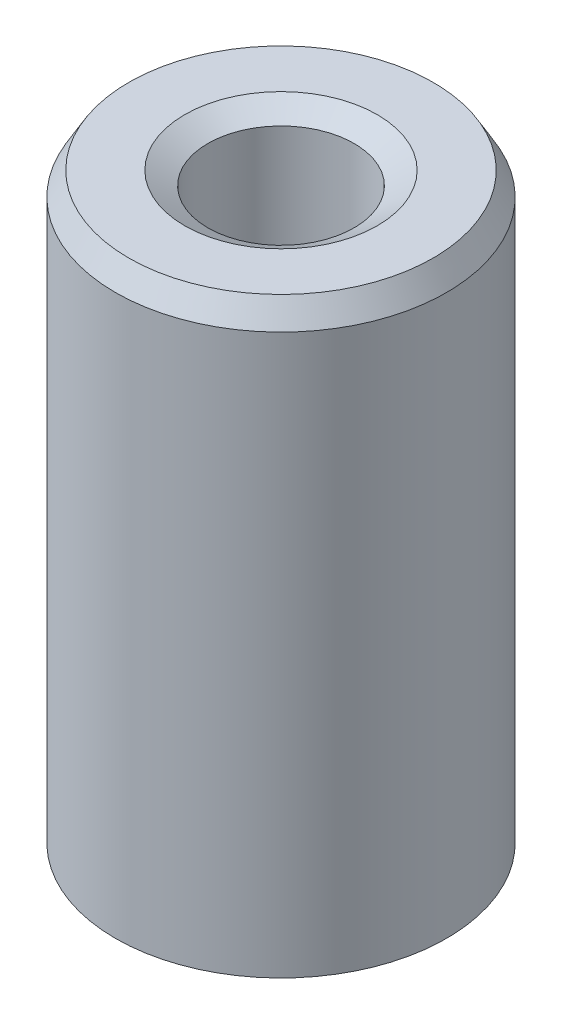
ISO-10303-21;
HEADER;
FILE_DESCRIPTION(('STEP AP214'),'2;1');
FILE_NAME('part.step','',(''),(''),'','','');
FILE_SCHEMA(('AUTOMOTIVE_DESIGN { 1 0 10303 214 1 1 1 1 }'));
ENDSEC;
DATA;
#1=APPLICATION_CONTEXT('core data for automotive mechanical design processes');
#2=APPLICATION_PROTOCOL_DEFINITION('international standard','automotive_design',2000,#1);
#3=PRODUCT_CONTEXT('',#1,'mechanical');
#4=PRODUCT('Part','Part','',(#3));
#5=PRODUCT_RELATED_PRODUCT_CATEGORY('part','',(#4));
#6=PRODUCT_DEFINITION_FORMATION('','',#4);
#7=PRODUCT_DEFINITION_CONTEXT('part definition',#1,'design');
#8=PRODUCT_DEFINITION('design','',#6,#7);
#9=PRODUCT_DEFINITION_SHAPE('','',#8);
#10=(LENGTH_UNIT() NAMED_UNIT(*) SI_UNIT(.MILLI.,.METRE.));
#11=(NAMED_UNIT(*) PLANE_ANGLE_UNIT() SI_UNIT($,.RADIAN.));
#12=(NAMED_UNIT(*) SI_UNIT($,.STERADIAN.) SOLID_ANGLE_UNIT());
#13=UNCERTAINTY_MEASURE_WITH_UNIT(LENGTH_MEASURE(1.E-05),#10,'distance_accuracy_value','');
#14=(GEOMETRIC_REPRESENTATION_CONTEXT(3) GLOBAL_UNCERTAINTY_ASSIGNED_CONTEXT((#13)) GLOBAL_UNIT_ASSIGNED_CONTEXT((#10,
#11,#12)) REPRESENTATION_CONTEXT('',''));
#15=CARTESIAN_POINT('',(0.,0.,0.));
#16=DIRECTION('',(0.,0.,1.));
#17=DIRECTION('',(1.,0.,0.));
#18=AXIS2_PLACEMENT_3D('',#15,#16,#17);
#19=CARTESIAN_POINT('',(0.,80.9748100954943,0.));
#20=DIRECTION('',(0.,-1.,0.));
#21=DIRECTION('',(0.,0.,-1.));
#22=AXIS2_PLACEMENT_3D('',#19,#20,#21);
#23=CYLINDRICAL_SURFACE('',#22,22.5);
#24=CARTESIAN_POINT('',(0.,1.81710164754692,0.));
#25=DIRECTION('',(0.,1.,0.));
#26=DIRECTION('',(0.,0.,1.));
#27=AXIS2_PLACEMENT_3D('',#24,#25,#26);
#28=CIRCLE('',#27,22.5);
#29=CARTESIAN_POINT('',(0.,1.81710164754692,22.5));
#30=VERTEX_POINT('',#29);
#31=EDGE_CURVE('E10',#30,#30,#28,.T.);
#32=ORIENTED_EDGE('',*,*,#31,.T.);
#33=EDGE_LOOP('',(#32));
#34=FACE_BOUND('',#33,.T.);
#35=CARTESIAN_POINT('',(0.,77.8274977194259,0.));
#36=DIRECTION('',(0.,1.,0.));
#37=DIRECTION('',(0.,0.,1.));
#38=AXIS2_PLACEMENT_3D('',#35,#36,#37);
#39=CIRCLE('',#38,22.5);
#40=CARTESIAN_POINT('',(0.,77.8274977194259,22.5));
#41=VERTEX_POINT('',#40);
#42=EDGE_CURVE('E50',#41,#41,#39,.F.);
#43=ORIENTED_EDGE('',*,*,#42,.T.);
#44=EDGE_LOOP('',(#43));
#45=FACE_BOUND('',#44,.T.);
#46=ADVANCED_FACE('F39',(#34,#45),#23,.T.);
#47=CARTESIAN_POINT('',(0.,80.9748100954943,0.));
#48=DIRECTION('',(0.,1.,0.));
#49=DIRECTION('',(0.,0.,1.));
#50=AXIS2_PLACEMENT_3D('',#47,#48,#49);
#51=PLANE('',#50);
#52=CARTESIAN_POINT('',(0.,80.9748100954943,0.));
#53=DIRECTION('',(0.,1.,0.));
#54=DIRECTION('',(0.,0.,1.));
#55=AXIS2_PLACEMENT_3D('',#52,#53,#54);
#56=CIRCLE('',#55,13.0852176142285);
#57=CARTESIAN_POINT('',(0.,80.9748100954943,13.0852176142285));
#58=VERTEX_POINT('',#57);
#59=EDGE_CURVE('E58',#58,#58,#56,.F.);
#60=ORIENTED_EDGE('',*,*,#59,.T.);
#61=EDGE_LOOP('',(#60));
#62=FACE_BOUND('',#61,.T.);
#63=CARTESIAN_POINT('',(0.,80.9748100954943,0.));
#64=DIRECTION('',(0.,1.,0.));
#65=DIRECTION('',(0.,0.,1.));
#66=AXIS2_PLACEMENT_3D('',#63,#64,#65);
#67=CIRCLE('',#66,20.6828983524531);
#68=CARTESIAN_POINT('',(0.,80.9748100954943,20.6828983524531));
#69=VERTEX_POINT('',#68);
#70=EDGE_CURVE('E61',#69,#69,#67,.T.);
#71=ORIENTED_EDGE('',*,*,#70,.T.);
#72=EDGE_LOOP('',(#71));
#73=FACE_BOUND('',#72,.T.);
#74=ADVANCED_FACE('F88',(#62,#73),#51,.T.);
#75=CARTESIAN_POINT('',(0.,0.,0.));
#76=DIRECTION('',(0.,1.,0.));
#77=DIRECTION('',(0.,0.,1.));
#78=AXIS2_PLACEMENT_3D('',#75,#76,#77);
#79=PLANE('',#78);
#80=CARTESIAN_POINT('',(0.,0.,0.));
#81=DIRECTION('',(0.,1.,0.));
#82=DIRECTION('',(0.,0.,1.));
#83=AXIS2_PLACEMENT_3D('',#80,#81,#82);
#84=CIRCLE('',#83,11.755006885707);
#85=CARTESIAN_POINT('',(0.,0.,11.755006885707));
#86=VERTEX_POINT('',#85);
#87=EDGE_CURVE('E51',#86,#86,#84,.T.);
#88=ORIENTED_EDGE('',*,*,#87,.T.);
#89=EDGE_LOOP('',(#88));
#90=FACE_BOUND('',#89,.T.);
#91=CARTESIAN_POINT('',(0.,0.,0.));
#92=DIRECTION('',(0.,1.,0.));
#93=DIRECTION('',(0.,0.,1.));
#94=AXIS2_PLACEMENT_3D('',#91,#92,#93);
#95=CIRCLE('',#94,19.3526876239316);
#96=CARTESIAN_POINT('',(0.,0.,19.3526876239316));
#97=VERTEX_POINT('',#96);
#98=EDGE_CURVE('E54',#97,#97,#95,.F.);
#99=ORIENTED_EDGE('',*,*,#98,.T.);
#100=EDGE_LOOP('',(#99));
#101=FACE_BOUND('',#100,.T.);
#102=ADVANCED_FACE('F83',(#90,#101),#79,.F.);
#103=CARTESIAN_POINT('',(0.,80.9748100954943,0.));
#104=DIRECTION('',(0.,-1.,0.));
#105=DIRECTION('',(0.,0.,-1.));
#106=AXIS2_PLACEMENT_3D('',#103,#104,#105);
#107=CYLINDRICAL_SURFACE('',#106,9.93790523816009);
#108=CARTESIAN_POINT('',(0.,79.1577084479474,0.));
#109=DIRECTION('',(0.,1.,0.));
#110=DIRECTION('',(0.,0.,1.));
#111=AXIS2_PLACEMENT_3D('',#108,#109,#110);
#112=CIRCLE('',#111,9.93790523816009);
#113=CARTESIAN_POINT('',(0.,79.1577084479474,9.93790523816007));
#114=VERTEX_POINT('',#113);
#115=EDGE_CURVE('E67',#114,#114,#112,.T.);
#116=ORIENTED_EDGE('',*,*,#115,.T.);
#117=EDGE_LOOP('',(#116));
#118=FACE_BOUND('',#117,.T.);
#119=CARTESIAN_POINT('',(0.,3.14731237606843,0.));
#120=DIRECTION('',(0.,1.,0.));
#121=DIRECTION('',(0.,0.,1.));
#122=AXIS2_PLACEMENT_3D('',#119,#120,#121);
#123=CIRCLE('',#122,9.93790523816009);
#124=CARTESIAN_POINT('',(0.,3.14731237606843,9.93790523816009));
#125=VERTEX_POINT('',#124);
#126=EDGE_CURVE('E69',#125,#125,#123,.F.);
#127=ORIENTED_EDGE('',*,*,#126,.T.);
#128=EDGE_LOOP('',(#127));
#129=FACE_BOUND('',#128,.T.);
#130=ADVANCED_FACE('F71',(#118,#129),#107,.F.);
#131=CARTESIAN_POINT('',(0.,79.1577084479474,0.));
#132=DIRECTION('',(0.,1.,0.));
#133=DIRECTION('',(0.,0.,1.));
#134=AXIS2_PLACEMENT_3D('',#131,#132,#133);
#135=CONICAL_SURFACE('',#134,9.93790523816009,1.0471975511966);
#136=CARTESIAN_POINT('',(0.,80.9748100954943,13.0852176142285));
#137=CARTESIAN_POINT('',(0.,80.9558819533324,13.0524331103111));
#138=CARTESIAN_POINT('',(0.,80.9369538111704,13.0196486063937));
#139=CARTESIAN_POINT('',(0.,80.8990975268465,12.954079598559));
#140=CARTESIAN_POINT('',(0.,80.8801693846846,12.9212950946416));
#141=CARTESIAN_POINT('',(0.,80.8423131003607,12.8557260868068));
#142=CARTESIAN_POINT('',(0.,80.8233849581987,12.8229415828895));
#143=CARTESIAN_POINT('',(0.,80.7855286738748,12.7573725750547));
#144=CARTESIAN_POINT('',(0.,80.7666005317129,12.7245880711373));
#145=CARTESIAN_POINT('',(0.,80.728744247389,12.6590190633026));
#146=CARTESIAN_POINT('',(0.,80.709816105227,12.6262345593852));
#147=CARTESIAN_POINT('',(0.,80.6719598209031,12.5606655515504));
#148=CARTESIAN_POINT('',(0.,80.6530316787412,12.527881047633));
#149=CARTESIAN_POINT('',(0.,80.6151753944173,12.4623120397983));
#150=CARTESIAN_POINT('',(0.,80.5962472522554,12.4295275358809));
#151=CARTESIAN_POINT('',(0.,80.5583909679314,12.3639585280461));
#152=CARTESIAN_POINT('',(0.,80.5394628257695,12.3311740241288));
#153=CARTESIAN_POINT('',(0.,80.5016065414456,12.265605016294));
#154=CARTESIAN_POINT('',(0.,80.4826783992837,12.2328205123766));
#155=CARTESIAN_POINT('',(0.,80.4448221149598,12.1672515045419));
#156=CARTESIAN_POINT('',(0.,80.4258939727978,12.1344670006245));
#157=CARTESIAN_POINT('',(0.,80.3880376884739,12.0688979927897));
#158=CARTESIAN_POINT('',(0.,80.369109546312,12.0361134888723));
#159=CARTESIAN_POINT('',(0.,80.3312532619881,11.9705444810376));
#160=CARTESIAN_POINT('',(0.,80.3123251198261,11.9377599771202));
#161=CARTESIAN_POINT('',(0.,80.2744688355022,11.8721909692855));
#162=CARTESIAN_POINT('',(0.,80.2555406933403,11.8394064653681));
#163=CARTESIAN_POINT('',(0.,80.2176844090164,11.7738374575333));
#164=CARTESIAN_POINT('',(0.,80.1987562668545,11.7410529536159));
#165=CARTESIAN_POINT('',(0.,80.1608999825306,11.6754839457812));
#166=CARTESIAN_POINT('',(0.,80.1419718403686,11.6426994418638));
#167=CARTESIAN_POINT('',(0.,80.1041155560447,11.577130434029));
#168=CARTESIAN_POINT('',(0.,80.0851874138828,11.5443459301117));
#169=CARTESIAN_POINT('',(0.,80.0473311295589,11.4787769222769));
#170=CARTESIAN_POINT('',(0.,80.0284029873969,11.4459924183595));
#171=CARTESIAN_POINT('',(0.,79.990546703073,11.3804234105248));
#172=CARTESIAN_POINT('',(0.,79.9716185609111,11.3476389066074));
#173=CARTESIAN_POINT('',(0.,79.9337622765872,11.2820698987726));
#174=CARTESIAN_POINT('',(0.,79.9148341344252,11.2492853948552));
#175=CARTESIAN_POINT('',(0.,79.8769778501014,11.1837163870205));
#176=CARTESIAN_POINT('',(0.,79.8580497079394,11.1509318831031));
#177=CARTESIAN_POINT('',(0.,79.8201934236155,11.0853628752683));
#178=CARTESIAN_POINT('',(0.,79.8012652814536,11.052578371351));
#179=CARTESIAN_POINT('',(0.,79.7634089971297,10.9870093635162));
#180=CARTESIAN_POINT('',(0.,79.7444808549677,10.9542248595988));
#181=CARTESIAN_POINT('',(0.,79.7066245706438,10.8886558517641));
#182=CARTESIAN_POINT('',(0.,79.6876964284819,10.8558713478467));
#183=CARTESIAN_POINT('',(0.,79.649840144158,10.7903023400119));
#184=CARTESIAN_POINT('',(0.,79.630912001996,10.7575178360946));
#185=CARTESIAN_POINT('',(0.,79.5930557176721,10.6919488282598));
#186=CARTESIAN_POINT('',(0.,79.5741275755102,10.6591643243424));
#187=CARTESIAN_POINT('',(0.,79.5362712911863,10.5935953165077));
#188=CARTESIAN_POINT('',(0.,79.5173431490244,10.5608108125903));
#189=CARTESIAN_POINT('',(0.,79.4794868647005,10.4952418047555));
#190=CARTESIAN_POINT('',(0.,79.4605587225385,10.4624573008381));
#191=CARTESIAN_POINT('',(0.,79.4227024382146,10.3968882930034));
#192=CARTESIAN_POINT('',(0.,79.4037742960527,10.364103789086));
#193=CARTESIAN_POINT('',(0.,79.3659180117288,10.2985347812512));
#194=CARTESIAN_POINT('',(0.,79.3469898695668,10.2657502773339));
#195=CARTESIAN_POINT('',(0.,79.3091335852429,10.2001812694991));
#196=CARTESIAN_POINT('',(0.,79.290205443081,10.1673967655817));
#197=CARTESIAN_POINT('',(0.,79.2523491587571,10.101827757747));
#198=CARTESIAN_POINT('',(0.,79.2334210165952,10.0690432538296));
#199=CARTESIAN_POINT('',(0.,79.1955647322713,10.0034742459948));
#200=CARTESIAN_POINT('',(0.,79.1766365901093,9.97068974207745));
#201=CARTESIAN_POINT('',(0.,79.1577084479474,9.93790523816007));
#202=B_SPLINE_CURVE_WITH_KNOTS('',3,(#136,#137,#138,#139,#140,#141,#142,#143,#144,#145,#146,
#147,#148,#149,#150,#151,#152,#153,#154,#155,#156,#157,#158,#159,#160,#161,#162,#163,#164,#165,
#166,#167,#168,#169,#170,#171,#172,#173,#174,#175,#176,#177,#178,#179,#180,#181,#182,#183,#184,
#185,#186,#187,#188,#189,#190,#191,#192,#193,#194,#195,#196,#197,#198,#199,#200,#201),
.UNSPECIFIED.,.F.,.F.,(4,2,2,2,2,2,2,2,2,2,2,2,2,2,2,2,2,2,2,2,2,2,2,2,2,2,2,2,2,2,2,2,4),(0.,
0.11356885297169,0.227137705943369,0.340706558915059,0.454275411886739,0.567844264858421,
0.681413117830108,0.794981970801791,0.908550823773471,1.02211967674516,1.13568852971684,
1.24925738268852,1.36282623566021,1.47639508863189,1.58996394160357,1.70353279457526,
1.81710164754694,1.93067050051862,2.04423935349031,2.15780820646199,2.27137705943367,
2.38494591240536,2.49851476537704,2.61208361834872,2.72565247132041,2.83922132429209,
2.95279017726378,3.06635903023546,3.17992788320714,3.29349673617883,3.40706558915051,
3.5206344421222,3.63420329509388),.UNSPECIFIED.);
#203=EDGE_CURVE('BSEAM77',#58,#114,#202,.T.);
#204=ORIENTED_EDGE('',*,*,#59,.F.);
#205=ORIENTED_EDGE('',*,*,#115,.F.);
#206=ORIENTED_EDGE('',*,*,#203,.T.);
#207=ORIENTED_EDGE('',*,*,#203,.F.);
#208=EDGE_LOOP('',(#204,#206,#205,#207));
#209=FACE_BOUND('',#208,.T.);
#210=ADVANCED_FACE('F77',(#209),#135,.F.);
#211=CARTESIAN_POINT('',(0.,0.,0.));
#212=DIRECTION('',(0.,-1.,0.));
#213=DIRECTION('',(0.,0.,-1.));
#214=AXIS2_PLACEMENT_3D('',#211,#212,#213);
#215=CONICAL_SURFACE('',#214,11.755006885707,0.523598775598294);
#216=ORIENTED_EDGE('',*,*,#126,.F.);
#217=EDGE_LOOP('',(#216));
#218=FACE_BOUND('',#217,.T.);
#219=ORIENTED_EDGE('',*,*,#87,.F.);
#220=EDGE_LOOP('',(#219));
#221=FACE_BOUND('',#220,.T.);
#222=ADVANCED_FACE('F73',(#218,#221),#215,.F.);
#223=CARTESIAN_POINT('',(0.,1.81710164754692,0.));
#224=DIRECTION('',(0.,1.,0.));
#225=DIRECTION('',(0.,0.,1.));
#226=AXIS2_PLACEMENT_3D('',#223,#224,#225);
#227=CONICAL_SURFACE('',#226,22.5,1.0471975511966);
#228=CARTESIAN_POINT('',(0.,0.,19.3526876239316));
#229=CARTESIAN_POINT('',(0.,0.0189281421619465,19.385472127849));
#230=CARTESIAN_POINT('',(0.,0.0378562843238938,19.4182566317664));
#231=CARTESIAN_POINT('',(0.,0.0757125686477883,19.4838256396011));
#232=CARTESIAN_POINT('',(0.,0.0946407108097356,19.5166101435185));
#233=CARTESIAN_POINT('',(0.,0.13249699513363,19.5821791513533));
#234=CARTESIAN_POINT('',(0.,0.151425137295576,19.6149636552706));
#235=CARTESIAN_POINT('',(0.,0.18928142161947,19.6805326631054));
#236=CARTESIAN_POINT('',(0.,0.208209563781418,19.7133171670228));
#237=CARTESIAN_POINT('',(0.,0.246065848105312,19.7788861748575));
#238=CARTESIAN_POINT('',(0.,0.264993990267259,19.8116706787749));
#239=CARTESIAN_POINT('',(0.,0.302850274591153,19.8772396866097));
#240=CARTESIAN_POINT('',(0.,0.3217784167531,19.9100241905271));
#241=CARTESIAN_POINT('',(0.,0.359634701076995,19.9755931983618));
#242=CARTESIAN_POINT('',(0.,0.378562843238941,20.0083777022792));
#243=CARTESIAN_POINT('',(0.,0.416419127562836,20.0739467101139));
#244=CARTESIAN_POINT('',(0.,0.435347269724783,20.1067312140313));
#245=CARTESIAN_POINT('',(0.,0.473203554048677,20.1723002218661));
#246=CARTESIAN_POINT('',(0.,0.492131696210624,20.2050847257835));
#247=CARTESIAN_POINT('',(0.,0.529987980534518,20.2706537336182));
#248=CARTESIAN_POINT('',(0.,0.548916122696466,20.3034382375356));
#249=CARTESIAN_POINT('',(0.,0.58677240702036,20.3690072453704));
#250=CARTESIAN_POINT('',(0.,0.605700549182306,20.4017917492877));
#251=CARTESIAN_POINT('',(0.,0.6435568335062,20.4673607571225));
#252=CARTESIAN_POINT('',(0.,0.662484975668148,20.5001452610399));
#253=CARTESIAN_POINT('',(0.,0.700341259992042,20.5657142688746));
#254=CARTESIAN_POINT('',(0.,0.71926940215399,20.598498772792));
#255=CARTESIAN_POINT('',(0.,0.757125686477884,20.6640677806268));
#256=CARTESIAN_POINT('',(0.,0.77605382863983,20.6968522845441));
#257=CARTESIAN_POINT('',(0.,0.813910112963724,20.7624212923789));
#258=CARTESIAN_POINT('',(0.,0.832838255125672,20.7952057962963));
#259=CARTESIAN_POINT('',(0.,0.870694539449566,20.860774804131));
#260=CARTESIAN_POINT('',(0.,0.889622681611513,20.8935593080484));
#261=CARTESIAN_POINT('',(0.,0.927478965935407,20.9591283158832));
#262=CARTESIAN_POINT('',(0.,0.946407108097354,20.9919128198006));
#263=CARTESIAN_POINT('',(0.,0.984263392421248,21.0574818276353));
#264=CARTESIAN_POINT('',(0.,1.0031915345832,21.0902663315527));
#265=CARTESIAN_POINT('',(0.,1.04104781890709,21.1558353393875));
#266=CARTESIAN_POINT('',(0.,1.05997596106904,21.1886198433048));
#267=CARTESIAN_POINT('',(0.,1.09783224539293,21.2541888511396));
#268=CARTESIAN_POINT('',(0.,1.11676038755488,21.286973355057));
#269=CARTESIAN_POINT('',(0.,1.15461667187877,21.3525423628917));
#270=CARTESIAN_POINT('',(0.,1.17354481404072,21.3853268668091));
#271=CARTESIAN_POINT('',(0.,1.21140109836461,21.4508958746439));
#272=CARTESIAN_POINT('',(0.,1.23032924052656,21.4836803785612));
#273=CARTESIAN_POINT('',(0.,1.26818552485045,21.549249386396));
#274=CARTESIAN_POINT('',(0.,1.2871136670124,21.5820338903134));
#275=CARTESIAN_POINT('',(0.,1.3249699513363,21.6476028981481));
#276=CARTESIAN_POINT('',(0.,1.34389809349824,21.6803874020655));
#277=CARTESIAN_POINT('',(0.,1.38175437782214,21.7459564099003));
#278=CARTESIAN_POINT('',(0.,1.40068251998408,21.7787409138177));
#279=CARTESIAN_POINT('',(0.,1.43853880430798,21.8443099216524));
#280=CARTESIAN_POINT('',(0.,1.45746694646993,21.8770944255698));
#281=CARTESIAN_POINT('',(0.,1.49532323079382,21.9426634334046));
#282=CARTESIAN_POINT('',(0.,1.51425137295577,21.9754479373219));
#283=CARTESIAN_POINT('',(0.,1.55210765727966,22.0410169451567));
#284=CARTESIAN_POINT('',(0.,1.57103579944161,22.0738014490741));
#285=CARTESIAN_POINT('',(0.,1.6088920837655,22.1393704569088));
#286=CARTESIAN_POINT('',(0.,1.62782022592745,22.1721549608262));
#287=CARTESIAN_POINT('',(0.,1.66567651025134,22.237723968661));
#288=CARTESIAN_POINT('',(0.,1.68460465241329,22.2705084725783));
#289=CARTESIAN_POINT('',(0.,1.72246093673719,22.3360774804131));
#290=CARTESIAN_POINT('',(0.,1.74138907889913,22.3688619843305));
#291=CARTESIAN_POINT('',(0.,1.77924536322303,22.4344309921652));
#292=CARTESIAN_POINT('',(0.,1.79817350538497,22.4672154960826));
#293=CARTESIAN_POINT('',(0.,1.81710164754692,22.5));
#294=B_SPLINE_CURVE_WITH_KNOTS('',3,(#228,#229,#230,#231,#232,#233,#234,#235,#236,#237,#238,
#239,#240,#241,#242,#243,#244,#245,#246,#247,#248,#249,#250,#251,#252,#253,#254,#255,#256,#257,
#258,#259,#260,#261,#262,#263,#264,#265,#266,#267,#268,#269,#270,#271,#272,#273,#274,#275,#276,
#277,#278,#279,#280,#281,#282,#283,#284,#285,#286,#287,#288,#289,#290,#291,#292,#293),
.UNSPECIFIED.,.F.,.F.,(4,2,2,2,2,2,2,2,2,2,2,2,2,2,2,2,2,2,2,2,2,2,2,2,2,2,2,2,2,2,2,2,4),(0.,
0.113568852971682,0.227137705943364,0.340706558915049,0.45427541188673,0.567844264858415,
0.681413117830097,0.794981970801779,0.908550823773461,1.02211967674515,1.13568852971683,
1.24925738268851,1.36282623566019,1.47639508863188,1.58996394160356,1.70353279457524,
1.81710164754693,1.93067050051861,2.04423935349029,2.15780820646197,2.27137705943366,
2.38494591240534,2.49851476537702,2.61208361834871,2.72565247132039,2.83922132429207,
2.95279017726375,3.06635903023544,3.17992788320712,3.2934967361788,3.40706558915048,
3.52063444212217,3.63420329509385),.UNSPECIFIED.);
#295=EDGE_CURVE('BSEAM76',#97,#30,#294,.T.);
#296=ORIENTED_EDGE('',*,*,#98,.F.);
#297=ORIENTED_EDGE('',*,*,#31,.F.);
#298=ORIENTED_EDGE('',*,*,#295,.T.);
#299=ORIENTED_EDGE('',*,*,#295,.F.);
#300=EDGE_LOOP('',(#296,#298,#297,#299));
#301=FACE_BOUND('',#300,.T.);
#302=ADVANCED_FACE('F76',(#301),#227,.T.);
#303=CARTESIAN_POINT('',(0.,80.9748100954943,0.));
#304=DIRECTION('',(0.,-1.,0.));
#305=DIRECTION('',(0.,0.,-1.));
#306=AXIS2_PLACEMENT_3D('',#303,#304,#305);
#307=CONICAL_SURFACE('',#306,20.6828983524531,0.523598775598294);
#308=ORIENTED_EDGE('',*,*,#42,.F.);
#309=EDGE_LOOP('',(#308));
#310=FACE_BOUND('',#309,.T.);
#311=ORIENTED_EDGE('',*,*,#70,.F.);
#312=EDGE_LOOP('',(#311));
#313=FACE_BOUND('',#312,.T.);
#314=ADVANCED_FACE('F45',(#310,#313),#307,.T.);
#315=CLOSED_SHELL('',(#46,#74,#102,#130,#210,#222,#302,#314));
#316=MANIFOLD_SOLID_BREP('B2',#315);
#317=ADVANCED_BREP_SHAPE_REPRESENTATION('',(#18,#316),#14);
#318=SHAPE_DEFINITION_REPRESENTATION(#9,#317);
ENDSEC;
END-ISO-10303-21;
